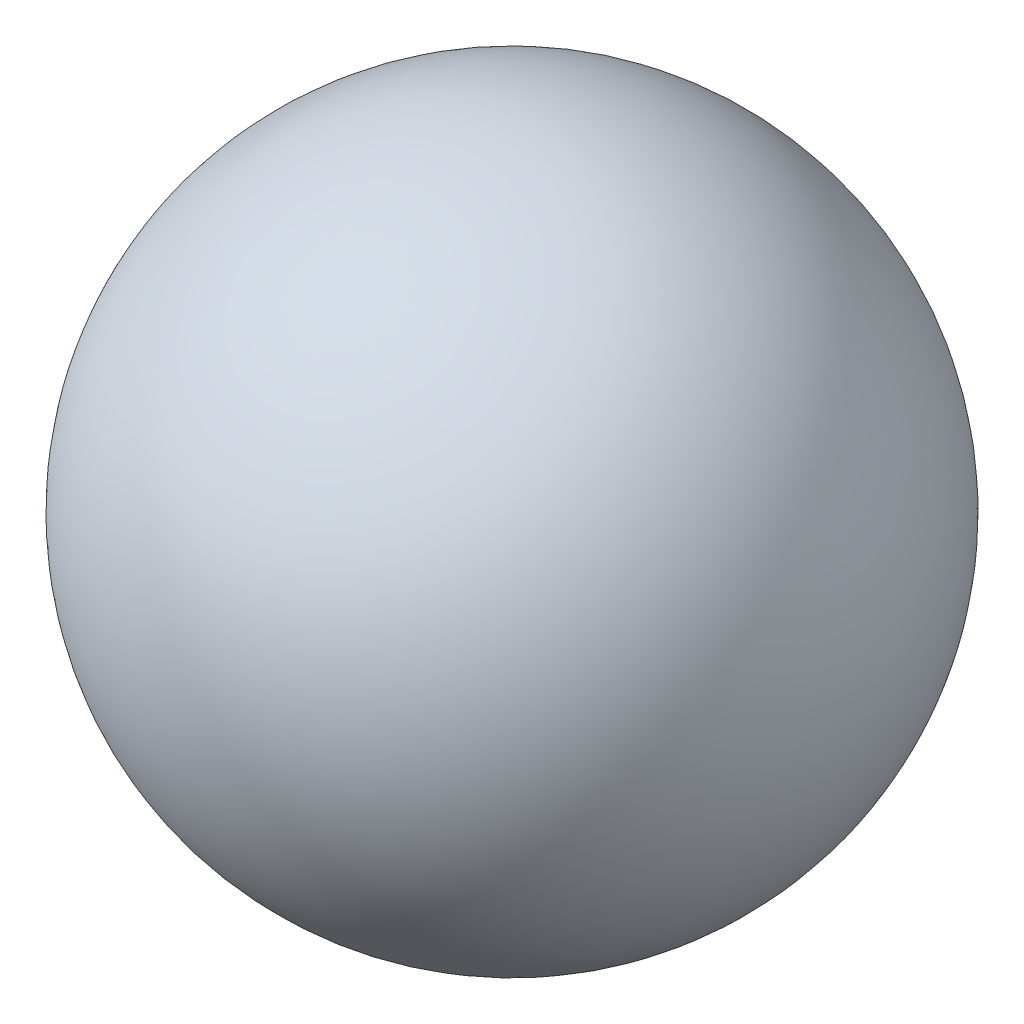
ISO-10303-21;
HEADER;
FILE_DESCRIPTION(('STEP AP214'),'2;1');
FILE_NAME('part.step','',(''),(''),'','','');
FILE_SCHEMA(('AUTOMOTIVE_DESIGN { 1 0 10303 214 1 1 1 1 }'));
ENDSEC;
DATA;
#1=APPLICATION_CONTEXT('core data for automotive mechanical design processes');
#2=APPLICATION_PROTOCOL_DEFINITION('international standard','automotive_design',2000,#1);
#3=PRODUCT_CONTEXT('',#1,'mechanical');
#4=PRODUCT('Part','Part','',(#3));
#5=PRODUCT_RELATED_PRODUCT_CATEGORY('part','',(#4));
#6=PRODUCT_DEFINITION_FORMATION('','',#4);
#7=PRODUCT_DEFINITION_CONTEXT('part definition',#1,'design');
#8=PRODUCT_DEFINITION('design','',#6,#7);
#9=PRODUCT_DEFINITION_SHAPE('','',#8);
#10=(LENGTH_UNIT() NAMED_UNIT(*) SI_UNIT(.MILLI.,.METRE.));
#11=(NAMED_UNIT(*) PLANE_ANGLE_UNIT() SI_UNIT($,.RADIAN.));
#12=(NAMED_UNIT(*) SI_UNIT($,.STERADIAN.) SOLID_ANGLE_UNIT());
#13=UNCERTAINTY_MEASURE_WITH_UNIT(LENGTH_MEASURE(1.E-05),#10,'distance_accuracy_value','');
#14=(GEOMETRIC_REPRESENTATION_CONTEXT(3) GLOBAL_UNCERTAINTY_ASSIGNED_CONTEXT((#13)) GLOBAL_UNIT_ASSIGNED_CONTEXT((#10,
#11,#12)) REPRESENTATION_CONTEXT('',''));
#15=CARTESIAN_POINT('',(0.,0.,0.));
#16=DIRECTION('',(0.,0.,1.));
#17=DIRECTION('',(1.,0.,0.));
#18=AXIS2_PLACEMENT_3D('',#15,#16,#17);
#19=CARTESIAN_POINT('',(0.,0.,0.));
#20=DIRECTION('',(-1.,0.,0.));
#21=DIRECTION('',(0.,0.,-1.));
#22=AXIS2_PLACEMENT_3D('',#19,#20,#21);
#23=SPHERICAL_SURFACE('',#22,17.5);
#24=CARTESIAN_POINT('',(-17.5,0.,0.));
#25=VERTEX_POINT('',#24);
#26=VERTEX_LOOP('',#25);
#27=FACE_BOUND('',#26,.T.);
#28=ADVANCED_FACE('F41',(#27),#23,.T.);
#29=CLOSED_SHELL('',(#28));
#30=MANIFOLD_SOLID_BREP('B2',#29);
#31=ADVANCED_BREP_SHAPE_REPRESENTATION('',(#18,#30),#14);
#32=SHAPE_DEFINITION_REPRESENTATION(#9,#31);
ENDSEC;
END-ISO-10303-21;
